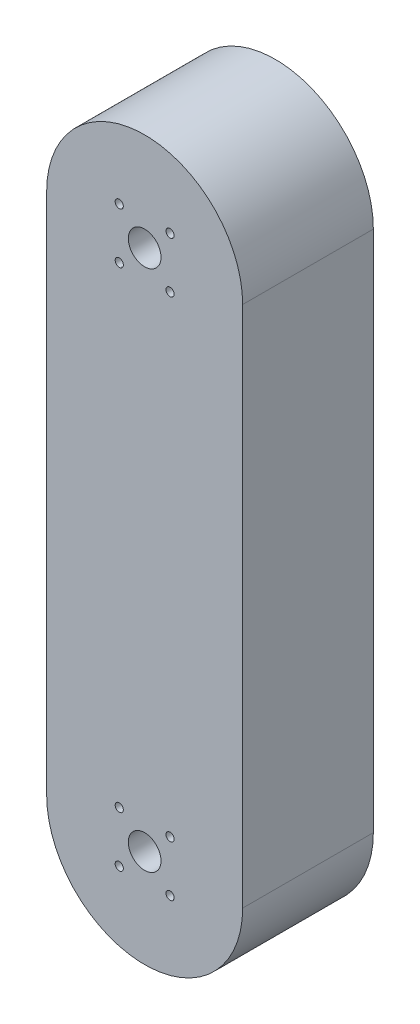
ISO-10303-21;
HEADER;
FILE_DESCRIPTION(('STEP AP214'),'2;1');
FILE_NAME('part.step','',(''),(''),'','','');
FILE_SCHEMA(('AUTOMOTIVE_DESIGN { 1 0 10303 214 1 1 1 1 }'));
ENDSEC;
DATA;
#1=APPLICATION_CONTEXT('core data for automotive mechanical design processes');
#2=APPLICATION_PROTOCOL_DEFINITION('international standard','automotive_design',2000,#1);
#3=PRODUCT_CONTEXT('',#1,'mechanical');
#4=PRODUCT('Part','Part','',(#3));
#5=PRODUCT_RELATED_PRODUCT_CATEGORY('part','',(#4));
#6=PRODUCT_DEFINITION_FORMATION('','',#4);
#7=PRODUCT_DEFINITION_CONTEXT('part definition',#1,'design');
#8=PRODUCT_DEFINITION('design','',#6,#7);
#9=PRODUCT_DEFINITION_SHAPE('','',#8);
#10=(LENGTH_UNIT() NAMED_UNIT(*) SI_UNIT(.MILLI.,.METRE.));
#11=(NAMED_UNIT(*) PLANE_ANGLE_UNIT() SI_UNIT($,.RADIAN.));
#12=(NAMED_UNIT(*) SI_UNIT($,.STERADIAN.) SOLID_ANGLE_UNIT());
#13=UNCERTAINTY_MEASURE_WITH_UNIT(LENGTH_MEASURE(1.E-05),#10,'distance_accuracy_value','');
#14=(GEOMETRIC_REPRESENTATION_CONTEXT(3) GLOBAL_UNCERTAINTY_ASSIGNED_CONTEXT((#13)) GLOBAL_UNIT_ASSIGNED_CONTEXT((#10,
#11,#12)) REPRESENTATION_CONTEXT('',''));
#15=CARTESIAN_POINT('',(0.,0.,0.));
#16=DIRECTION('',(0.,0.,1.));
#17=DIRECTION('',(1.,0.,0.));
#18=AXIS2_PLACEMENT_3D('',#15,#16,#17);
#19=CARTESIAN_POINT('',(0.,-50.8,25.4));
#20=DIRECTION('',(0.,0.,-1.));
#21=DIRECTION('',(-1.,0.,0.));
#22=AXIS2_PLACEMENT_3D('',#19,#20,#21);
#23=CYLINDRICAL_SURFACE('',#22,19.05);
#24=CARTESIAN_POINT('',(0.,-50.8,0.));
#25=DIRECTION('',(0.,0.,1.));
#26=DIRECTION('',(1.,0.,0.));
#27=AXIS2_PLACEMENT_3D('',#24,#25,#26);
#28=CIRCLE('',#27,19.05);
#29=CARTESIAN_POINT('',(-19.05,-50.8,0.));
#30=VERTEX_POINT('',#29);
#31=CARTESIAN_POINT('',(19.05,-50.8,0.));
#32=VERTEX_POINT('',#31);
#33=EDGE_CURVE('E96',#30,#32,#28,.T.);
#34=ORIENTED_EDGE('',*,*,#33,.T.);
#35=DIRECTION('',(0.,0.,-1.));
#36=VECTOR('',#35,1.);
#37=CARTESIAN_POINT('',(19.05,-50.8,25.4));
#38=LINE('',#37,#36);
#39=CARTESIAN_POINT('',(19.05,-50.8,25.4));
#40=VERTEX_POINT('',#39);
#41=EDGE_CURVE('E11',#40,#32,#38,.T.);
#42=ORIENTED_EDGE('',*,*,#41,.F.);
#43=CARTESIAN_POINT('',(0.,-50.8,25.4));
#44=DIRECTION('',(0.,0.,1.));
#45=DIRECTION('',(1.,0.,0.));
#46=AXIS2_PLACEMENT_3D('',#43,#44,#45);
#47=CIRCLE('',#46,19.05);
#48=CARTESIAN_POINT('',(-19.05,-50.8,25.4));
#49=VERTEX_POINT('',#48);
#50=EDGE_CURVE('E84',#49,#40,#47,.T.);
#51=ORIENTED_EDGE('',*,*,#50,.F.);
#52=DIRECTION('',(0.,0.,-1.));
#53=VECTOR('',#52,1.);
#54=CARTESIAN_POINT('',(-19.05,-50.8,25.4));
#55=LINE('',#54,#53);
#56=EDGE_CURVE('E92',#49,#30,#55,.T.);
#57=ORIENTED_EDGE('',*,*,#56,.T.);
#58=EDGE_LOOP('',(#34,#42,#51,#57));
#59=FACE_BOUND('',#58,.T.);
#60=ADVANCED_FACE('F33',(#59),#23,.T.);
#61=CARTESIAN_POINT('',(19.05,50.8,25.4));
#62=DIRECTION('',(-1.,0.,0.));
#63=DIRECTION('',(0.,-1.,0.));
#64=AXIS2_PLACEMENT_3D('',#61,#62,#63);
#65=PLANE('',#64);
#66=DIRECTION('',(0.,1.,0.));
#67=VECTOR('',#66,1.);
#68=CARTESIAN_POINT('',(19.05,50.8,0.));
#69=LINE('',#68,#67);
#70=CARTESIAN_POINT('',(19.05,50.8,0.));
#71=VERTEX_POINT('',#70);
#72=EDGE_CURVE('E88',#32,#71,#69,.T.);
#73=ORIENTED_EDGE('',*,*,#72,.T.);
#74=DIRECTION('',(0.,0.,-1.));
#75=VECTOR('',#74,1.);
#76=CARTESIAN_POINT('',(19.05,50.8,25.4));
#77=LINE('',#76,#75);
#78=CARTESIAN_POINT('',(19.05,50.8,25.4));
#79=VERTEX_POINT('',#78);
#80=EDGE_CURVE('E41',#79,#71,#77,.T.);
#81=ORIENTED_EDGE('',*,*,#80,.F.);
#82=DIRECTION('',(0.,1.,0.));
#83=VECTOR('',#82,1.);
#84=CARTESIAN_POINT('',(19.05,50.8,25.4));
#85=LINE('',#84,#83);
#86=EDGE_CURVE('E79',#40,#79,#85,.T.);
#87=ORIENTED_EDGE('',*,*,#86,.F.);
#88=ORIENTED_EDGE('',*,*,#41,.T.);
#89=EDGE_LOOP('',(#73,#81,#87,#88));
#90=FACE_BOUND('',#89,.T.);
#91=ADVANCED_FACE('F87',(#90),#65,.F.);
#92=CARTESIAN_POINT('',(0.,50.8,25.4));
#93=DIRECTION('',(0.,0.,-1.));
#94=DIRECTION('',(-1.,0.,0.));
#95=AXIS2_PLACEMENT_3D('',#92,#93,#94);
#96=CYLINDRICAL_SURFACE('',#95,19.05);
#97=CARTESIAN_POINT('',(0.,50.8,0.));
#98=DIRECTION('',(0.,0.,1.));
#99=DIRECTION('',(-1.,0.,0.));
#100=AXIS2_PLACEMENT_3D('',#97,#98,#99);
#101=CIRCLE('',#100,19.05);
#102=CARTESIAN_POINT('',(-19.05,50.8,0.));
#103=VERTEX_POINT('',#102);
#104=EDGE_CURVE('E66',#71,#103,#101,.T.);
#105=ORIENTED_EDGE('',*,*,#104,.T.);
#106=DIRECTION('',(0.,0.,-1.));
#107=VECTOR('',#106,1.);
#108=CARTESIAN_POINT('',(-19.05,50.8,25.4));
#109=LINE('',#108,#107);
#110=CARTESIAN_POINT('',(-19.05,50.8,25.4));
#111=VERTEX_POINT('',#110);
#112=EDGE_CURVE('E89',#111,#103,#109,.T.);
#113=ORIENTED_EDGE('',*,*,#112,.F.);
#114=CARTESIAN_POINT('',(0.,50.8,25.4));
#115=DIRECTION('',(0.,0.,1.));
#116=DIRECTION('',(-1.,0.,0.));
#117=AXIS2_PLACEMENT_3D('',#114,#115,#116);
#118=CIRCLE('',#117,19.05);
#119=EDGE_CURVE('E82',#79,#111,#118,.T.);
#120=ORIENTED_EDGE('',*,*,#119,.F.);
#121=ORIENTED_EDGE('',*,*,#80,.T.);
#122=EDGE_LOOP('',(#105,#113,#120,#121));
#123=FACE_BOUND('',#122,.T.);
#124=ADVANCED_FACE('F90',(#123),#96,.T.);
#125=CARTESIAN_POINT('',(-19.05,50.8,25.4));
#126=DIRECTION('',(1.,0.,0.));
#127=DIRECTION('',(0.,1.,0.));
#128=AXIS2_PLACEMENT_3D('',#125,#126,#127);
#129=PLANE('',#128);
#130=DIRECTION('',(0.,-1.,0.));
#131=VECTOR('',#130,1.);
#132=CARTESIAN_POINT('',(-19.05,50.8,0.));
#133=LINE('',#132,#131);
#134=EDGE_CURVE('E72',#103,#30,#133,.T.);
#135=ORIENTED_EDGE('',*,*,#134,.T.);
#136=ORIENTED_EDGE('',*,*,#56,.F.);
#137=DIRECTION('',(0.,-1.,0.));
#138=VECTOR('',#137,1.);
#139=CARTESIAN_POINT('',(-19.05,50.8,25.4));
#140=LINE('',#139,#138);
#141=EDGE_CURVE('E49',#111,#49,#140,.T.);
#142=ORIENTED_EDGE('',*,*,#141,.F.);
#143=ORIENTED_EDGE('',*,*,#112,.T.);
#144=EDGE_LOOP('',(#135,#136,#142,#143));
#145=FACE_BOUND('',#144,.T.);
#146=ADVANCED_FACE('F104',(#145),#129,.F.);
#147=CARTESIAN_POINT('',(0.,-50.8,25.4));
#148=DIRECTION('',(0.,0.,1.));
#149=DIRECTION('',(1.,0.,0.));
#150=AXIS2_PLACEMENT_3D('',#147,#148,#149);
#151=PLANE('',#150);
#152=CARTESIAN_POINT('',(4.93914086658801,-45.8608591334119,25.4));
#153=DIRECTION('',(0.,0.,-1.));
#154=DIRECTION('',(1.,0.,0.));
#155=AXIS2_PLACEMENT_3D('',#152,#153,#154);
#156=CIRCLE('',#155,0.79375);
#157=CARTESIAN_POINT('',(5.73289086658801,-45.8608591334119,25.4));
#158=VERTEX_POINT('',#157);
#159=EDGE_CURVE('E149',#158,#158,#156,.T.);
#160=ORIENTED_EDGE('',*,*,#159,.T.);
#161=EDGE_LOOP('',(#160));
#162=FACE_BOUND('',#161,.T.);
#163=CARTESIAN_POINT('',(4.93914086658806,-55.739140866588,25.4));
#164=DIRECTION('',(0.,0.,-1.));
#165=DIRECTION('',(1.,0.,0.));
#166=AXIS2_PLACEMENT_3D('',#163,#164,#165);
#167=CIRCLE('',#166,0.79375);
#168=CARTESIAN_POINT('',(5.73289086658806,-55.739140866588,25.4));
#169=VERTEX_POINT('',#168);
#170=EDGE_CURVE('E155',#169,#169,#167,.T.);
#171=ORIENTED_EDGE('',*,*,#170,.T.);
#172=EDGE_LOOP('',(#171));
#173=FACE_BOUND('',#172,.T.);
#174=CARTESIAN_POINT('',(-4.93914086658805,-45.860859133412,25.4));
#175=DIRECTION('',(0.,0.,-1.));
#176=DIRECTION('',(1.,0.,0.));
#177=AXIS2_PLACEMENT_3D('',#174,#175,#176);
#178=CIRCLE('',#177,0.793749999999997);
#179=CARTESIAN_POINT('',(-4.14539086658806,-45.860859133412,25.4));
#180=VERTEX_POINT('',#179);
#181=EDGE_CURVE('E161',#180,#180,#178,.T.);
#182=ORIENTED_EDGE('',*,*,#181,.T.);
#183=EDGE_LOOP('',(#182));
#184=FACE_BOUND('',#183,.T.);
#185=CARTESIAN_POINT('',(-4.93914086658801,-55.7391408665881,25.4));
#186=DIRECTION('',(0.,0.,-1.));
#187=DIRECTION('',(1.,0.,0.));
#188=AXIS2_PLACEMENT_3D('',#185,#186,#187);
#189=CIRCLE('',#188,0.793750000000002);
#190=CARTESIAN_POINT('',(-4.14539086658801,-55.7391408665881,25.4));
#191=VERTEX_POINT('',#190);
#192=EDGE_CURVE('E143',#191,#191,#189,.T.);
#193=ORIENTED_EDGE('',*,*,#192,.T.);
#194=EDGE_LOOP('',(#193));
#195=FACE_BOUND('',#194,.T.);
#196=CARTESIAN_POINT('',(0.,-50.8,25.4));
#197=DIRECTION('',(0.,0.,-1.));
#198=DIRECTION('',(1.,0.,0.));
#199=AXIS2_PLACEMENT_3D('',#196,#197,#198);
#200=CIRCLE('',#199,3.175);
#201=CARTESIAN_POINT('',(3.175,-50.8,25.4));
#202=VERTEX_POINT('',#201);
#203=EDGE_CURVE('E123',#202,#202,#200,.T.);
#204=ORIENTED_EDGE('',*,*,#203,.T.);
#205=EDGE_LOOP('',(#204));
#206=FACE_BOUND('',#205,.T.);
#207=CARTESIAN_POINT('',(4.93914086658801,45.8608591334119,25.4));
#208=DIRECTION('',(0.,0.,1.));
#209=DIRECTION('',(1.,0.,0.));
#210=AXIS2_PLACEMENT_3D('',#207,#208,#209);
#211=CIRCLE('',#210,0.79375);
#212=CARTESIAN_POINT('',(5.73289086658801,45.8608591334119,25.4));
#213=VERTEX_POINT('',#212);
#214=EDGE_CURVE('E120',#213,#213,#211,.T.);
#215=ORIENTED_EDGE('',*,*,#214,.F.);
#216=EDGE_LOOP('',(#215));
#217=FACE_BOUND('',#216,.T.);
#218=CARTESIAN_POINT('',(4.93914086658806,55.739140866588,25.4));
#219=DIRECTION('',(0.,0.,1.));
#220=DIRECTION('',(1.,0.,0.));
#221=AXIS2_PLACEMENT_3D('',#218,#219,#220);
#222=CIRCLE('',#221,0.79375);
#223=CARTESIAN_POINT('',(5.73289086658806,55.739140866588,25.4));
#224=VERTEX_POINT('',#223);
#225=EDGE_CURVE('E119',#224,#224,#222,.T.);
#226=ORIENTED_EDGE('',*,*,#225,.F.);
#227=EDGE_LOOP('',(#226));
#228=FACE_BOUND('',#227,.T.);
#229=CARTESIAN_POINT('',(-4.93914086658805,45.860859133412,25.4));
#230=DIRECTION('',(0.,0.,1.));
#231=DIRECTION('',(1.,0.,0.));
#232=AXIS2_PLACEMENT_3D('',#229,#230,#231);
#233=CIRCLE('',#232,0.793749999999997);
#234=CARTESIAN_POINT('',(-4.14539086658806,45.860859133412,25.4));
#235=VERTEX_POINT('',#234);
#236=EDGE_CURVE('E127',#235,#235,#233,.T.);
#237=ORIENTED_EDGE('',*,*,#236,.F.);
#238=EDGE_LOOP('',(#237));
#239=FACE_BOUND('',#238,.T.);
#240=CARTESIAN_POINT('',(-4.93914086658801,55.7391408665881,25.4));
#241=DIRECTION('',(0.,0.,1.));
#242=DIRECTION('',(1.,0.,0.));
#243=AXIS2_PLACEMENT_3D('',#240,#241,#242);
#244=CIRCLE('',#243,0.793750000000002);
#245=CARTESIAN_POINT('',(-4.14539086658801,55.7391408665881,25.4));
#246=VERTEX_POINT('',#245);
#247=EDGE_CURVE('E133',#246,#246,#244,.T.);
#248=ORIENTED_EDGE('',*,*,#247,.F.);
#249=EDGE_LOOP('',(#248));
#250=FACE_BOUND('',#249,.T.);
#251=CARTESIAN_POINT('',(0.,50.8,25.4));
#252=DIRECTION('',(0.,0.,1.));
#253=DIRECTION('',(1.,0.,0.));
#254=AXIS2_PLACEMENT_3D('',#251,#252,#253);
#255=CIRCLE('',#254,3.175);
#256=CARTESIAN_POINT('',(3.175,50.8,25.4));
#257=VERTEX_POINT('',#256);
#258=EDGE_CURVE('E112',#257,#257,#255,.T.);
#259=ORIENTED_EDGE('',*,*,#258,.F.);
#260=EDGE_LOOP('',(#259));
#261=FACE_BOUND('',#260,.T.);
#262=ORIENTED_EDGE('',*,*,#50,.T.);
#263=ORIENTED_EDGE('',*,*,#86,.T.);
#264=ORIENTED_EDGE('',*,*,#119,.T.);
#265=ORIENTED_EDGE('',*,*,#141,.T.);
#266=EDGE_LOOP('',(#262,#263,#264,#265));
#267=FACE_BOUND('',#266,.T.);
#268=ADVANCED_FACE('F80',(#162,#173,#184,#195,#206,#217,#228,#239,#250,#261,#267),#151,.T.);
#269=CARTESIAN_POINT('',(0.,-50.8,0.));
#270=DIRECTION('',(0.,0.,1.));
#271=DIRECTION('',(1.,0.,0.));
#272=AXIS2_PLACEMENT_3D('',#269,#270,#271);
#273=PLANE('',#272);
#274=CARTESIAN_POINT('',(4.93914086658801,-45.8608591334119,0.));
#275=DIRECTION('',(0.,0.,1.));
#276=DIRECTION('',(1.,0.,0.));
#277=AXIS2_PLACEMENT_3D('',#274,#275,#276);
#278=CIRCLE('',#277,0.79375);
#279=CARTESIAN_POINT('',(5.73289086658801,-45.8608591334119,0.));
#280=VERTEX_POINT('',#279);
#281=EDGE_CURVE('E146',#280,#280,#278,.T.);
#282=ORIENTED_EDGE('',*,*,#281,.T.);
#283=EDGE_LOOP('',(#282));
#284=FACE_BOUND('',#283,.T.);
#285=CARTESIAN_POINT('',(4.93914086658806,-55.739140866588,0.));
#286=DIRECTION('',(0.,0.,1.));
#287=DIRECTION('',(1.,0.,0.));
#288=AXIS2_PLACEMENT_3D('',#285,#286,#287);
#289=CIRCLE('',#288,0.79375);
#290=CARTESIAN_POINT('',(5.73289086658806,-55.739140866588,0.));
#291=VERTEX_POINT('',#290);
#292=EDGE_CURVE('E152',#291,#291,#289,.T.);
#293=ORIENTED_EDGE('',*,*,#292,.T.);
#294=EDGE_LOOP('',(#293));
#295=FACE_BOUND('',#294,.T.);
#296=CARTESIAN_POINT('',(-4.93914086658805,-45.860859133412,0.));
#297=DIRECTION('',(0.,0.,1.));
#298=DIRECTION('',(1.,0.,0.));
#299=AXIS2_PLACEMENT_3D('',#296,#297,#298);
#300=CIRCLE('',#299,0.793749999999997);
#301=CARTESIAN_POINT('',(-4.14539086658806,-45.860859133412,0.));
#302=VERTEX_POINT('',#301);
#303=EDGE_CURVE('E158',#302,#302,#300,.T.);
#304=ORIENTED_EDGE('',*,*,#303,.T.);
#305=EDGE_LOOP('',(#304));
#306=FACE_BOUND('',#305,.T.);
#307=CARTESIAN_POINT('',(-4.93914086658801,-55.7391408665881,0.));
#308=DIRECTION('',(0.,0.,1.));
#309=DIRECTION('',(1.,0.,0.));
#310=AXIS2_PLACEMENT_3D('',#307,#308,#309);
#311=CIRCLE('',#310,0.793750000000002);
#312=CARTESIAN_POINT('',(-4.14539086658801,-55.7391408665881,0.));
#313=VERTEX_POINT('',#312);
#314=EDGE_CURVE('E164',#313,#313,#311,.T.);
#315=ORIENTED_EDGE('',*,*,#314,.T.);
#316=EDGE_LOOP('',(#315));
#317=FACE_BOUND('',#316,.T.);
#318=CARTESIAN_POINT('',(0.,-50.8,0.));
#319=DIRECTION('',(0.,0.,1.));
#320=DIRECTION('',(1.,0.,0.));
#321=AXIS2_PLACEMENT_3D('',#318,#319,#320);
#322=CIRCLE('',#321,3.175);
#323=CARTESIAN_POINT('',(3.175,-50.8,0.));
#324=VERTEX_POINT('',#323);
#325=EDGE_CURVE('E140',#324,#324,#322,.T.);
#326=ORIENTED_EDGE('',*,*,#325,.T.);
#327=EDGE_LOOP('',(#326));
#328=FACE_BOUND('',#327,.T.);
#329=CARTESIAN_POINT('',(4.93914086658801,45.8608591334119,0.));
#330=DIRECTION('',(0.,0.,1.));
#331=DIRECTION('',(1.,0.,0.));
#332=AXIS2_PLACEMENT_3D('',#329,#330,#331);
#333=CIRCLE('',#332,0.79375);
#334=CARTESIAN_POINT('',(5.73289086658801,45.8608591334119,0.));
#335=VERTEX_POINT('',#334);
#336=EDGE_CURVE('E116',#335,#335,#333,.F.);
#337=ORIENTED_EDGE('',*,*,#336,.F.);
#338=EDGE_LOOP('',(#337));
#339=FACE_BOUND('',#338,.T.);
#340=CARTESIAN_POINT('',(4.93914086658806,55.739140866588,0.));
#341=DIRECTION('',(0.,0.,1.));
#342=DIRECTION('',(1.,0.,0.));
#343=AXIS2_PLACEMENT_3D('',#340,#341,#342);
#344=CIRCLE('',#343,0.79375);
#345=CARTESIAN_POINT('',(5.73289086658806,55.739140866588,0.));
#346=VERTEX_POINT('',#345);
#347=EDGE_CURVE('E124',#346,#346,#344,.F.);
#348=ORIENTED_EDGE('',*,*,#347,.F.);
#349=EDGE_LOOP('',(#348));
#350=FACE_BOUND('',#349,.T.);
#351=CARTESIAN_POINT('',(-4.93914086658805,45.860859133412,0.));
#352=DIRECTION('',(0.,0.,1.));
#353=DIRECTION('',(1.,0.,0.));
#354=AXIS2_PLACEMENT_3D('',#351,#352,#353);
#355=CIRCLE('',#354,0.793749999999997);
#356=CARTESIAN_POINT('',(-4.14539086658806,45.860859133412,0.));
#357=VERTEX_POINT('',#356);
#358=EDGE_CURVE('E130',#357,#357,#355,.F.);
#359=ORIENTED_EDGE('',*,*,#358,.F.);
#360=EDGE_LOOP('',(#359));
#361=FACE_BOUND('',#360,.T.);
#362=CARTESIAN_POINT('',(-4.93914086658801,55.7391408665881,0.));
#363=DIRECTION('',(0.,0.,1.));
#364=DIRECTION('',(1.,0.,0.));
#365=AXIS2_PLACEMENT_3D('',#362,#363,#364);
#366=CIRCLE('',#365,0.793750000000002);
#367=CARTESIAN_POINT('',(-4.14539086658801,55.7391408665881,0.));
#368=VERTEX_POINT('',#367);
#369=EDGE_CURVE('E115',#368,#368,#366,.F.);
#370=ORIENTED_EDGE('',*,*,#369,.F.);
#371=EDGE_LOOP('',(#370));
#372=FACE_BOUND('',#371,.T.);
#373=CARTESIAN_POINT('',(0.,50.8,0.));
#374=DIRECTION('',(0.,0.,1.));
#375=DIRECTION('',(1.,0.,0.));
#376=AXIS2_PLACEMENT_3D('',#373,#374,#375);
#377=CIRCLE('',#376,3.175);
#378=CARTESIAN_POINT('',(3.175,50.8,0.));
#379=VERTEX_POINT('',#378);
#380=EDGE_CURVE('E99',#379,#379,#377,.F.);
#381=ORIENTED_EDGE('',*,*,#380,.F.);
#382=EDGE_LOOP('',(#381));
#383=FACE_BOUND('',#382,.T.);
#384=ORIENTED_EDGE('',*,*,#33,.F.);
#385=ORIENTED_EDGE('',*,*,#134,.F.);
#386=ORIENTED_EDGE('',*,*,#104,.F.);
#387=ORIENTED_EDGE('',*,*,#72,.F.);
#388=EDGE_LOOP('',(#384,#385,#386,#387));
#389=FACE_BOUND('',#388,.T.);
#390=ADVANCED_FACE('F107',(#284,#295,#306,#317,#328,#339,#350,#361,#372,#383,#389),#273,.F.);
#391=CARTESIAN_POINT('',(0.,50.8,-0.001000000000001));
#392=DIRECTION('',(0.,0.,1.));
#393=DIRECTION('',(1.,0.,0.));
#394=AXIS2_PLACEMENT_3D('',#391,#392,#393);
#395=CYLINDRICAL_SURFACE('',#394,3.175);
#396=ORIENTED_EDGE('',*,*,#258,.T.);
#397=EDGE_LOOP('',(#396));
#398=FACE_BOUND('',#397,.T.);
#399=ORIENTED_EDGE('',*,*,#380,.T.);
#400=EDGE_LOOP('',(#399));
#401=FACE_BOUND('',#400,.T.);
#402=ADVANCED_FACE('F182',(#398,#401),#395,.F.);
#403=CARTESIAN_POINT('',(-4.93914086658801,55.7391408665881,-0.001000000000001));
#404=DIRECTION('',(0.,0.,1.));
#405=DIRECTION('',(1.,0.,0.));
#406=AXIS2_PLACEMENT_3D('',#403,#404,#405);
#407=CYLINDRICAL_SURFACE('',#406,0.793750000000002);
#408=ORIENTED_EDGE('',*,*,#247,.T.);
#409=EDGE_LOOP('',(#408));
#410=FACE_BOUND('',#409,.T.);
#411=ORIENTED_EDGE('',*,*,#369,.T.);
#412=EDGE_LOOP('',(#411));
#413=FACE_BOUND('',#412,.T.);
#414=ADVANCED_FACE('F198',(#410,#413),#407,.F.);
#415=CARTESIAN_POINT('',(-4.93914086658805,45.860859133412,-0.001000000000001));
#416=DIRECTION('',(0.,0.,1.));
#417=DIRECTION('',(1.,0.,0.));
#418=AXIS2_PLACEMENT_3D('',#415,#416,#417);
#419=CYLINDRICAL_SURFACE('',#418,0.793749999999997);
#420=ORIENTED_EDGE('',*,*,#236,.T.);
#421=EDGE_LOOP('',(#420));
#422=FACE_BOUND('',#421,.T.);
#423=ORIENTED_EDGE('',*,*,#358,.T.);
#424=EDGE_LOOP('',(#423));
#425=FACE_BOUND('',#424,.T.);
#426=ADVANCED_FACE('F204',(#422,#425),#419,.F.);
#427=CARTESIAN_POINT('',(4.93914086658806,55.739140866588,-0.001000000000001));
#428=DIRECTION('',(0.,0.,1.));
#429=DIRECTION('',(1.,0.,0.));
#430=AXIS2_PLACEMENT_3D('',#427,#428,#429);
#431=CYLINDRICAL_SURFACE('',#430,0.79375);
#432=ORIENTED_EDGE('',*,*,#225,.T.);
#433=EDGE_LOOP('',(#432));
#434=FACE_BOUND('',#433,.T.);
#435=ORIENTED_EDGE('',*,*,#347,.T.);
#436=EDGE_LOOP('',(#435));
#437=FACE_BOUND('',#436,.T.);
#438=ADVANCED_FACE('F251',(#434,#437),#431,.F.);
#439=CARTESIAN_POINT('',(4.93914086658801,45.8608591334119,-0.001000000000001));
#440=DIRECTION('',(0.,0.,1.));
#441=DIRECTION('',(1.,0.,0.));
#442=AXIS2_PLACEMENT_3D('',#439,#440,#441);
#443=CYLINDRICAL_SURFACE('',#442,0.79375);
#444=ORIENTED_EDGE('',*,*,#214,.T.);
#445=EDGE_LOOP('',(#444));
#446=FACE_BOUND('',#445,.T.);
#447=ORIENTED_EDGE('',*,*,#336,.T.);
#448=EDGE_LOOP('',(#447));
#449=FACE_BOUND('',#448,.T.);
#450=ADVANCED_FACE('F246',(#446,#449),#443,.F.);
#451=CARTESIAN_POINT('',(0.,-50.8,-0.001000000000001));
#452=DIRECTION('',(0.,0.,1.));
#453=DIRECTION('',(1.,0.,0.));
#454=AXIS2_PLACEMENT_3D('',#451,#452,#453);
#455=CYLINDRICAL_SURFACE('',#454,3.175);
#456=ORIENTED_EDGE('',*,*,#203,.F.);
#457=EDGE_LOOP('',(#456));
#458=FACE_BOUND('',#457,.T.);
#459=ORIENTED_EDGE('',*,*,#325,.F.);
#460=EDGE_LOOP('',(#459));
#461=FACE_BOUND('',#460,.T.);
#462=ADVANCED_FACE('F176',(#458,#461),#455,.F.);
#463=CARTESIAN_POINT('',(-4.93914086658801,-55.7391408665881,-0.001000000000001));
#464=DIRECTION('',(0.,0.,1.));
#465=DIRECTION('',(1.,0.,0.));
#466=AXIS2_PLACEMENT_3D('',#463,#464,#465);
#467=CYLINDRICAL_SURFACE('',#466,0.793750000000002);
#468=ORIENTED_EDGE('',*,*,#192,.F.);
#469=EDGE_LOOP('',(#468));
#470=FACE_BOUND('',#469,.T.);
#471=ORIENTED_EDGE('',*,*,#314,.F.);
#472=EDGE_LOOP('',(#471));
#473=FACE_BOUND('',#472,.T.);
#474=ADVANCED_FACE('F172',(#470,#473),#467,.F.);
#475=CARTESIAN_POINT('',(-4.93914086658805,-45.860859133412,-0.001000000000001));
#476=DIRECTION('',(0.,0.,1.));
#477=DIRECTION('',(1.,0.,0.));
#478=AXIS2_PLACEMENT_3D('',#475,#476,#477);
#479=CYLINDRICAL_SURFACE('',#478,0.793749999999997);
#480=ORIENTED_EDGE('',*,*,#181,.F.);
#481=EDGE_LOOP('',(#480));
#482=FACE_BOUND('',#481,.T.);
#483=ORIENTED_EDGE('',*,*,#303,.F.);
#484=EDGE_LOOP('',(#483));
#485=FACE_BOUND('',#484,.T.);
#486=ADVANCED_FACE('F175',(#482,#485),#479,.F.);
#487=CARTESIAN_POINT('',(4.93914086658806,-55.739140866588,-0.001000000000001));
#488=DIRECTION('',(0.,0.,1.));
#489=DIRECTION('',(1.,0.,0.));
#490=AXIS2_PLACEMENT_3D('',#487,#488,#489);
#491=CYLINDRICAL_SURFACE('',#490,0.79375);
#492=ORIENTED_EDGE('',*,*,#170,.F.);
#493=EDGE_LOOP('',(#492));
#494=FACE_BOUND('',#493,.T.);
#495=ORIENTED_EDGE('',*,*,#292,.F.);
#496=EDGE_LOOP('',(#495));
#497=FACE_BOUND('',#496,.T.);
#498=ADVANCED_FACE('F231',(#494,#497),#491,.F.);
#499=CARTESIAN_POINT('',(4.93914086658801,-45.8608591334119,-0.001000000000001));
#500=DIRECTION('',(0.,0.,1.));
#501=DIRECTION('',(1.,0.,0.));
#502=AXIS2_PLACEMENT_3D('',#499,#500,#501);
#503=CYLINDRICAL_SURFACE('',#502,0.79375);
#504=ORIENTED_EDGE('',*,*,#159,.F.);
#505=EDGE_LOOP('',(#504));
#506=FACE_BOUND('',#505,.T.);
#507=ORIENTED_EDGE('',*,*,#281,.F.);
#508=EDGE_LOOP('',(#507));
#509=FACE_BOUND('',#508,.T.);
#510=ADVANCED_FACE('F238',(#506,#509),#503,.F.);
#511=CLOSED_SHELL('',(#60,#91,#124,#146,#268,#390,#402,#414,#426,#438,#450,#462,#474,#486,#498,#510));
#512=MANIFOLD_SOLID_BREP('B2',#511);
#513=ADVANCED_BREP_SHAPE_REPRESENTATION('',(#18,#512),#14);
#514=SHAPE_DEFINITION_REPRESENTATION(#9,#513);
ENDSEC;
END-ISO-10303-21;
